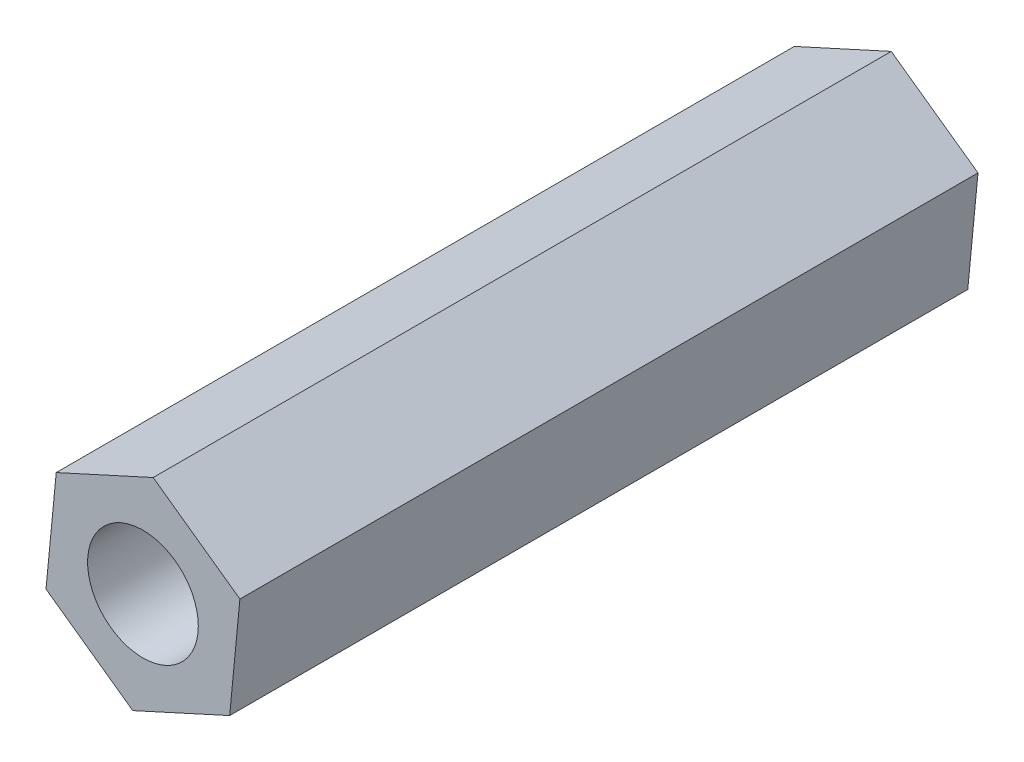
ISO-10303-21;
HEADER;
FILE_DESCRIPTION(('STEP AP214'),'2;1');
FILE_NAME('part.step','',(''),(''),'','','');
FILE_SCHEMA(('AUTOMOTIVE_DESIGN { 1 0 10303 214 1 1 1 1 }'));
ENDSEC;
DATA;
#1=APPLICATION_CONTEXT('core data for automotive mechanical design processes');
#2=APPLICATION_PROTOCOL_DEFINITION('international standard','automotive_design',2000,#1);
#3=PRODUCT_CONTEXT('',#1,'mechanical');
#4=PRODUCT('Part','Part','',(#3));
#5=PRODUCT_RELATED_PRODUCT_CATEGORY('part','',(#4));
#6=PRODUCT_DEFINITION_FORMATION('','',#4);
#7=PRODUCT_DEFINITION_CONTEXT('part definition',#1,'design');
#8=PRODUCT_DEFINITION('design','',#6,#7);
#9=PRODUCT_DEFINITION_SHAPE('','',#8);
#10=(LENGTH_UNIT() NAMED_UNIT(*) SI_UNIT(.MILLI.,.METRE.));
#11=(NAMED_UNIT(*) PLANE_ANGLE_UNIT() SI_UNIT($,.RADIAN.));
#12=(NAMED_UNIT(*) SI_UNIT($,.STERADIAN.) SOLID_ANGLE_UNIT());
#13=UNCERTAINTY_MEASURE_WITH_UNIT(LENGTH_MEASURE(1.E-05),#10,'distance_accuracy_value','');
#14=(GEOMETRIC_REPRESENTATION_CONTEXT(3) GLOBAL_UNCERTAINTY_ASSIGNED_CONTEXT((#13)) GLOBAL_UNIT_ASSIGNED_CONTEXT((#10,
#11,#12)) REPRESENTATION_CONTEXT('',''));
#15=CARTESIAN_POINT('',(0.,0.,0.));
#16=DIRECTION('',(0.,0.,1.));
#17=DIRECTION('',(1.,0.,0.));
#18=AXIS2_PLACEMENT_3D('',#15,#16,#17);
#19=CARTESIAN_POINT('',(0.,0.,20.));
#20=DIRECTION('',(0.,0.,1.));
#21=DIRECTION('',(1.,0.,0.));
#22=AXIS2_PLACEMENT_3D('',#19,#20,#21);
#23=PLANE('',#22);
#24=DIRECTION('',(0.0959864545210911,0.995382640268792,0.));
#25=VECTOR('',#24,1.);
#26=CARTESIAN_POINT('',(2.34991208728121,-1.6766772245674,20.));
#27=LINE('',#26,#25);
#28=CARTESIAN_POINT('',(2.34991208728121,-1.6766772245674,20.));
#29=VERTEX_POINT('',#28);
#30=CARTESIAN_POINT('',(2.62700111406275,1.19674495196194,20.));
#31=VERTEX_POINT('',#30);
#32=EDGE_CURVE('E129',#29,#31,#27,.T.);
#33=ORIENTED_EDGE('',*,*,#32,.T.);
#34=DIRECTION('',(-0.814033425698255,0.58081802816886,0.));
#35=VECTOR('',#34,1.);
#36=CARTESIAN_POINT('',(2.62700111406275,1.19674495196194,20.));
#37=LINE('',#36,#35);
#38=CARTESIAN_POINT('',(0.277089026781549,2.87342217652934,20.));
#39=VERTEX_POINT('',#38);
#40=EDGE_CURVE('E87',#31,#39,#37,.T.);
#41=ORIENTED_EDGE('',*,*,#40,.T.);
#42=DIRECTION('',(-0.910019880219347,-0.414564612099931,0.));
#43=VECTOR('',#42,1.);
#44=CARTESIAN_POINT('',(0.277089026781549,2.87342217652934,20.));
#45=LINE('',#44,#43);
#46=CARTESIAN_POINT('',(-2.3499120872812,1.6766772245674,20.));
#47=VERTEX_POINT('',#46);
#48=EDGE_CURVE('E100',#39,#47,#45,.T.);
#49=ORIENTED_EDGE('',*,*,#48,.T.);
#50=DIRECTION('',(-0.0959864545210913,-0.995382640268792,0.));
#51=VECTOR('',#50,1.);
#52=CARTESIAN_POINT('',(-2.3499120872812,1.6766772245674,20.));
#53=LINE('',#52,#51);
#54=CARTESIAN_POINT('',(-2.62700111406275,-1.19674495196194,20.));
#55=VERTEX_POINT('',#54);
#56=EDGE_CURVE('E94',#47,#55,#53,.T.);
#57=ORIENTED_EDGE('',*,*,#56,.T.);
#58=DIRECTION('',(0.814033425698255,-0.580818028168861,0.));
#59=VECTOR('',#58,1.);
#60=CARTESIAN_POINT('',(-2.62700111406275,-1.19674495196194,20.));
#61=LINE('',#60,#59);
#62=CARTESIAN_POINT('',(-0.277089026781548,-2.87342217652934,20.));
#63=VERTEX_POINT('',#62);
#64=EDGE_CURVE('E98',#55,#63,#61,.T.);
#65=ORIENTED_EDGE('',*,*,#64,.T.);
#66=DIRECTION('',(0.910019880219347,0.414564612099931,0.));
#67=VECTOR('',#66,1.);
#68=CARTESIAN_POINT('',(-0.277089026781548,-2.87342217652934,20.));
#69=LINE('',#68,#67);
#70=EDGE_CURVE('E50',#63,#29,#69,.T.);
#71=ORIENTED_EDGE('',*,*,#70,.T.);
#72=EDGE_LOOP('',(#33,#41,#49,#57,#65,#71));
#73=FACE_BOUND('',#72,.T.);
#74=CARTESIAN_POINT('',(0.,0.,20.));
#75=DIRECTION('',(0.,0.,1.));
#76=DIRECTION('',(1.,0.,0.));
#77=AXIS2_PLACEMENT_3D('',#74,#75,#76);
#78=CIRCLE('',#77,1.5);
#79=CARTESIAN_POINT('',(1.5,0.,20.));
#80=VERTEX_POINT('',#79);
#81=EDGE_CURVE('E122',#80,#80,#78,.T.);
#82=ORIENTED_EDGE('',*,*,#81,.F.);
#83=EDGE_LOOP('',(#82));
#84=FACE_BOUND('',#83,.T.);
#85=ADVANCED_FACE('F33',(#73,#84),#23,.T.);
#86=CARTESIAN_POINT('',(0.,0.,0.));
#87=DIRECTION('',(0.,0.,1.));
#88=DIRECTION('',(1.,0.,0.));
#89=AXIS2_PLACEMENT_3D('',#86,#87,#88);
#90=PLANE('',#89);
#91=DIRECTION('',(0.0959864545210911,0.995382640268792,0.));
#92=VECTOR('',#91,1.);
#93=CARTESIAN_POINT('',(2.34991208728121,-1.6766772245674,0.));
#94=LINE('',#93,#92);
#95=CARTESIAN_POINT('',(2.34991208728121,-1.6766772245674,0.));
#96=VERTEX_POINT('',#95);
#97=CARTESIAN_POINT('',(2.62700111406275,1.19674495196194,0.));
#98=VERTEX_POINT('',#97);
#99=EDGE_CURVE('E118',#96,#98,#94,.T.);
#100=ORIENTED_EDGE('',*,*,#99,.F.);
#101=DIRECTION('',(0.910019880219347,0.414564612099931,0.));
#102=VECTOR('',#101,1.);
#103=CARTESIAN_POINT('',(-0.277089026781548,-2.87342217652934,0.));
#104=LINE('',#103,#102);
#105=CARTESIAN_POINT('',(-0.277089026781548,-2.87342217652934,0.));
#106=VERTEX_POINT('',#105);
#107=EDGE_CURVE('E79',#106,#96,#104,.T.);
#108=ORIENTED_EDGE('',*,*,#107,.F.);
#109=DIRECTION('',(0.814033425698255,-0.580818028168861,0.));
#110=VECTOR('',#109,1.);
#111=CARTESIAN_POINT('',(-2.62700111406275,-1.19674495196194,0.));
#112=LINE('',#111,#110);
#113=CARTESIAN_POINT('',(-2.62700111406275,-1.19674495196194,0.));
#114=VERTEX_POINT('',#113);
#115=EDGE_CURVE('E73',#114,#106,#112,.T.);
#116=ORIENTED_EDGE('',*,*,#115,.F.);
#117=DIRECTION('',(-0.0959864545210913,-0.995382640268792,0.));
#118=VECTOR('',#117,1.);
#119=CARTESIAN_POINT('',(-2.3499120872812,1.6766772245674,0.));
#120=LINE('',#119,#118);
#121=CARTESIAN_POINT('',(-2.3499120872812,1.6766772245674,0.));
#122=VERTEX_POINT('',#121);
#123=EDGE_CURVE('E108',#122,#114,#120,.T.);
#124=ORIENTED_EDGE('',*,*,#123,.F.);
#125=DIRECTION('',(-0.910019880219347,-0.414564612099931,0.));
#126=VECTOR('',#125,1.);
#127=CARTESIAN_POINT('',(0.277089026781549,2.87342217652934,0.));
#128=LINE('',#127,#126);
#129=CARTESIAN_POINT('',(0.277089026781549,2.87342217652934,0.));
#130=VERTEX_POINT('',#129);
#131=EDGE_CURVE('E124',#130,#122,#128,.T.);
#132=ORIENTED_EDGE('',*,*,#131,.F.);
#133=DIRECTION('',(-0.814033425698255,0.58081802816886,0.));
#134=VECTOR('',#133,1.);
#135=CARTESIAN_POINT('',(2.62700111406275,1.19674495196194,0.));
#136=LINE('',#135,#134);
#137=EDGE_CURVE('E121',#98,#130,#136,.T.);
#138=ORIENTED_EDGE('',*,*,#137,.F.);
#139=EDGE_LOOP('',(#100,#108,#116,#124,#132,#138));
#140=FACE_BOUND('',#139,.T.);
#141=CARTESIAN_POINT('',(0.,0.,0.));
#142=DIRECTION('',(0.,0.,1.));
#143=DIRECTION('',(1.,0.,0.));
#144=AXIS2_PLACEMENT_3D('',#141,#142,#143);
#145=CIRCLE('',#144,1.5);
#146=CARTESIAN_POINT('',(1.5,0.,0.));
#147=VERTEX_POINT('',#146);
#148=EDGE_CURVE('E222',#147,#147,#145,.T.);
#149=ORIENTED_EDGE('',*,*,#148,.T.);
#150=EDGE_LOOP('',(#149));
#151=FACE_BOUND('',#150,.T.);
#152=ADVANCED_FACE('F138',(#140,#151),#90,.F.);
#153=CARTESIAN_POINT('',(2.34991208728121,-1.6766772245674,20.));
#154=DIRECTION('',(-0.995382640268792,0.0959864545210911,0.));
#155=DIRECTION('',(-0.0959864545210911,-0.995382640268792,0.));
#156=AXIS2_PLACEMENT_3D('',#153,#154,#155);
#157=PLANE('',#156);
#158=ORIENTED_EDGE('',*,*,#99,.T.);
#159=DIRECTION('',(0.,0.,-1.));
#160=VECTOR('',#159,1.);
#161=CARTESIAN_POINT('',(2.62700111406275,1.19674495196194,20.));
#162=LINE('',#161,#160);
#163=EDGE_CURVE('E11',#31,#98,#162,.T.);
#164=ORIENTED_EDGE('',*,*,#163,.F.);
#165=ORIENTED_EDGE('',*,*,#32,.F.);
#166=DIRECTION('',(0.,0.,-1.));
#167=VECTOR('',#166,1.);
#168=CARTESIAN_POINT('',(2.34991208728121,-1.6766772245674,20.));
#169=LINE('',#168,#167);
#170=EDGE_CURVE('E114',#29,#96,#169,.T.);
#171=ORIENTED_EDGE('',*,*,#170,.T.);
#172=EDGE_LOOP('',(#158,#164,#165,#171));
#173=FACE_BOUND('',#172,.T.);
#174=ADVANCED_FACE('F35',(#173),#157,.F.);
#175=CARTESIAN_POINT('',(2.62700111406275,1.19674495196194,20.));
#176=DIRECTION('',(-0.58081802816886,-0.814033425698255,0.));
#177=DIRECTION('',(0.814033425698255,-0.58081802816886,0.));
#178=AXIS2_PLACEMENT_3D('',#175,#176,#177);
#179=PLANE('',#178);
#180=ORIENTED_EDGE('',*,*,#137,.T.);
#181=DIRECTION('',(0.,0.,-1.));
#182=VECTOR('',#181,1.);
#183=CARTESIAN_POINT('',(0.277089026781549,2.87342217652934,20.));
#184=LINE('',#183,#182);
#185=EDGE_CURVE('E42',#39,#130,#184,.T.);
#186=ORIENTED_EDGE('',*,*,#185,.F.);
#187=ORIENTED_EDGE('',*,*,#40,.F.);
#188=ORIENTED_EDGE('',*,*,#163,.T.);
#189=EDGE_LOOP('',(#180,#186,#187,#188));
#190=FACE_BOUND('',#189,.T.);
#191=ADVANCED_FACE('F163',(#190),#179,.F.);
#192=CARTESIAN_POINT('',(0.277089026781549,2.87342217652934,20.));
#193=DIRECTION('',(0.414564612099931,-0.910019880219347,0.));
#194=DIRECTION('',(0.910019880219347,0.414564612099931,0.));
#195=AXIS2_PLACEMENT_3D('',#192,#193,#194);
#196=PLANE('',#195);
#197=ORIENTED_EDGE('',*,*,#131,.T.);
#198=DIRECTION('',(0.,0.,-1.));
#199=VECTOR('',#198,1.);
#200=CARTESIAN_POINT('',(-2.3499120872812,1.6766772245674,20.));
#201=LINE('',#200,#199);
#202=EDGE_CURVE('E109',#47,#122,#201,.T.);
#203=ORIENTED_EDGE('',*,*,#202,.F.);
#204=ORIENTED_EDGE('',*,*,#48,.F.);
#205=ORIENTED_EDGE('',*,*,#185,.T.);
#206=EDGE_LOOP('',(#197,#203,#204,#205));
#207=FACE_BOUND('',#206,.T.);
#208=ADVANCED_FACE('F135',(#207),#196,.F.);
#209=CARTESIAN_POINT('',(-2.3499120872812,1.6766772245674,20.));
#210=DIRECTION('',(0.995382640268792,-0.0959864545210913,0.));
#211=DIRECTION('',(0.0959864545210913,0.995382640268792,0.));
#212=AXIS2_PLACEMENT_3D('',#209,#210,#211);
#213=PLANE('',#212);
#214=ORIENTED_EDGE('',*,*,#123,.T.);
#215=DIRECTION('',(0.,0.,-1.));
#216=VECTOR('',#215,1.);
#217=CARTESIAN_POINT('',(-2.62700111406275,-1.19674495196194,20.));
#218=LINE('',#217,#216);
#219=EDGE_CURVE('E105',#55,#114,#218,.T.);
#220=ORIENTED_EDGE('',*,*,#219,.F.);
#221=ORIENTED_EDGE('',*,*,#56,.F.);
#222=ORIENTED_EDGE('',*,*,#202,.T.);
#223=EDGE_LOOP('',(#214,#220,#221,#222));
#224=FACE_BOUND('',#223,.T.);
#225=ADVANCED_FACE('F106',(#224),#213,.F.);
#226=CARTESIAN_POINT('',(-2.62700111406275,-1.19674495196194,20.));
#227=DIRECTION('',(0.580818028168861,0.814033425698255,0.));
#228=DIRECTION('',(-0.814033425698255,0.580818028168861,0.));
#229=AXIS2_PLACEMENT_3D('',#226,#227,#228);
#230=PLANE('',#229);
#231=ORIENTED_EDGE('',*,*,#115,.T.);
#232=DIRECTION('',(0.,0.,-1.));
#233=VECTOR('',#232,1.);
#234=CARTESIAN_POINT('',(-0.277089026781548,-2.87342217652934,20.));
#235=LINE('',#234,#233);
#236=EDGE_CURVE('E110',#63,#106,#235,.T.);
#237=ORIENTED_EDGE('',*,*,#236,.F.);
#238=ORIENTED_EDGE('',*,*,#64,.F.);
#239=ORIENTED_EDGE('',*,*,#219,.T.);
#240=EDGE_LOOP('',(#231,#237,#238,#239));
#241=FACE_BOUND('',#240,.T.);
#242=ADVANCED_FACE('F112',(#241),#230,.F.);
#243=CARTESIAN_POINT('',(-0.277089026781548,-2.87342217652934,20.));
#244=DIRECTION('',(-0.414564612099931,0.910019880219347,0.));
#245=DIRECTION('',(-0.910019880219347,-0.414564612099931,0.));
#246=AXIS2_PLACEMENT_3D('',#243,#244,#245);
#247=PLANE('',#246);
#248=ORIENTED_EDGE('',*,*,#107,.T.);
#249=ORIENTED_EDGE('',*,*,#170,.F.);
#250=ORIENTED_EDGE('',*,*,#70,.F.);
#251=ORIENTED_EDGE('',*,*,#236,.T.);
#252=EDGE_LOOP('',(#248,#249,#250,#251));
#253=FACE_BOUND('',#252,.T.);
#254=ADVANCED_FACE('F143',(#253),#247,.F.);
#255=CARTESIAN_POINT('',(0.,0.,20.));
#256=DIRECTION('',(0.,0.,-1.));
#257=DIRECTION('',(-1.,0.,0.));
#258=AXIS2_PLACEMENT_3D('',#255,#256,#257);
#259=CYLINDRICAL_SURFACE('',#258,1.5);
#260=ORIENTED_EDGE('',*,*,#81,.T.);
#261=EDGE_LOOP('',(#260));
#262=FACE_BOUND('',#261,.T.);
#263=ORIENTED_EDGE('',*,*,#148,.F.);
#264=EDGE_LOOP('',(#263));
#265=FACE_BOUND('',#264,.T.);
#266=ADVANCED_FACE('F145',(#262,#265),#259,.F.);
#267=CLOSED_SHELL('',(#85,#152,#174,#191,#208,#225,#242,#254,#266));
#268=MANIFOLD_SOLID_BREP('B2',#267);
#269=ADVANCED_BREP_SHAPE_REPRESENTATION('',(#18,#268),#14);
#270=SHAPE_DEFINITION_REPRESENTATION(#9,#269);
ENDSEC;
END-ISO-10303-21;
